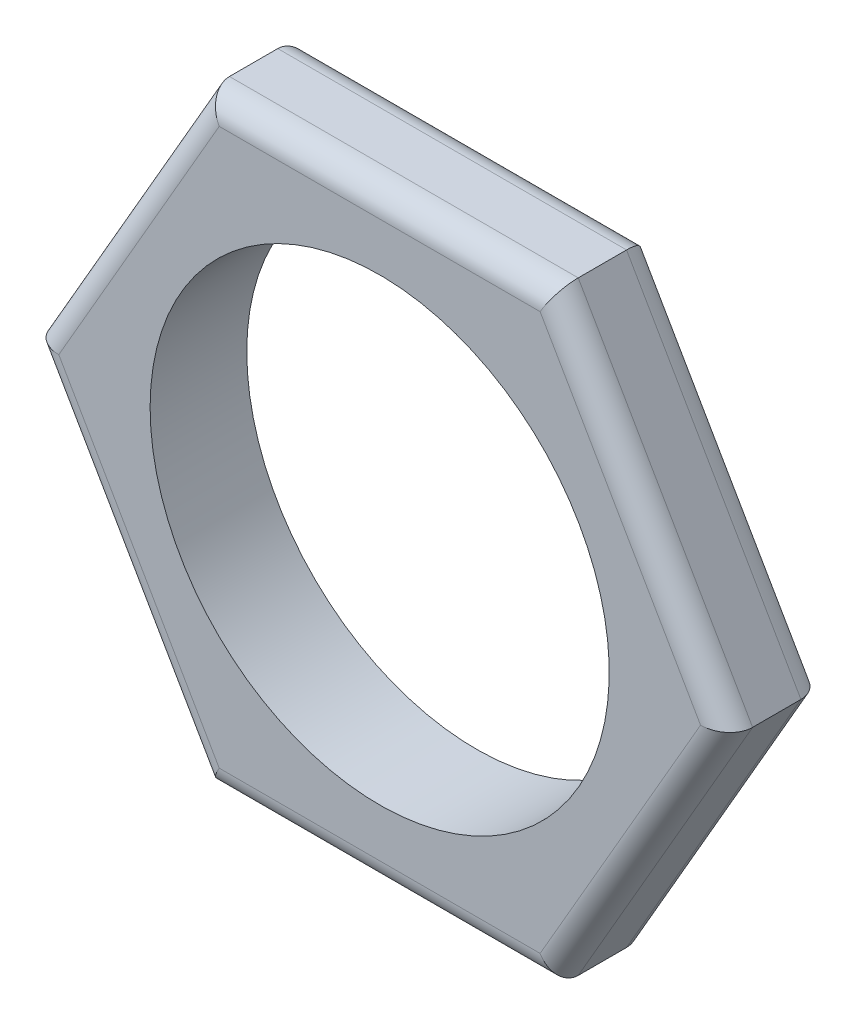
ISO-10303-21;
HEADER;
FILE_DESCRIPTION(('STEP AP214'),'2;1');
FILE_NAME('part.step','',(''),(''),'','','');
FILE_SCHEMA(('AUTOMOTIVE_DESIGN { 1 0 10303 214 1 1 1 1 }'));
ENDSEC;
DATA;
#1=APPLICATION_CONTEXT('core data for automotive mechanical design processes');
#2=APPLICATION_PROTOCOL_DEFINITION('international standard','automotive_design',2000,#1);
#3=PRODUCT_CONTEXT('',#1,'mechanical');
#4=PRODUCT('Part','Part','',(#3));
#5=PRODUCT_RELATED_PRODUCT_CATEGORY('part','',(#4));
#6=PRODUCT_DEFINITION_FORMATION('','',#4);
#7=PRODUCT_DEFINITION_CONTEXT('part definition',#1,'design');
#8=PRODUCT_DEFINITION('design','',#6,#7);
#9=PRODUCT_DEFINITION_SHAPE('','',#8);
#10=(LENGTH_UNIT() NAMED_UNIT(*) SI_UNIT(.MILLI.,.METRE.));
#11=(NAMED_UNIT(*) PLANE_ANGLE_UNIT() SI_UNIT($,.RADIAN.));
#12=(NAMED_UNIT(*) SI_UNIT($,.STERADIAN.) SOLID_ANGLE_UNIT());
#13=UNCERTAINTY_MEASURE_WITH_UNIT(LENGTH_MEASURE(1.E-05),#10,'distance_accuracy_value','');
#14=(GEOMETRIC_REPRESENTATION_CONTEXT(3) GLOBAL_UNCERTAINTY_ASSIGNED_CONTEXT((#13)) GLOBAL_UNIT_ASSIGNED_CONTEXT((#10,
#11,#12)) REPRESENTATION_CONTEXT('',''));
#15=CARTESIAN_POINT('',(0.,0.,0.));
#16=DIRECTION('',(0.,0.,1.));
#17=DIRECTION('',(1.,0.,0.));
#18=AXIS2_PLACEMENT_3D('',#15,#16,#17);
#19=CARTESIAN_POINT('',(-8.61550939198223,0.317499999999979,-0.635));
#20=DIRECTION('',(0.500000000000001,-0.866025403784438,0.));
#21=DIRECTION('',(0.866025403784438,0.500000000000001,0.));
#22=AXIS2_PLACEMENT_3D('',#19,#20,#21);
#23=CYLINDRICAL_SURFACE('',#22,0.635);
#24=CARTESIAN_POINT('',(-8.43220068151452,0.,-0.635));
#25=DIRECTION('',(0.,-1.,0.));
#26=DIRECTION('',(-1.,0.,0.));
#27=AXIS2_PLACEMENT_3D('',#24,#25,#26);
#28=ELLIPSE('',#27,0.733234841870825,0.635);
#29=CARTESIAN_POINT('',(-8.43220068151453,0.,-1.27));
#30=VERTEX_POINT('',#29);
#31=CARTESIAN_POINT('',(-9.16543552338535,0.,-0.635));
#32=VERTEX_POINT('',#31);
#33=EDGE_CURVE('E180',#30,#32,#28,.F.);
#34=ORIENTED_EDGE('',*,*,#33,.F.);
#35=DIRECTION('',(0.500000000000001,-0.866025403784438,0.));
#36=VECTOR('',#35,1.);
#37=CARTESIAN_POINT('',(-8.43220068151452,0.,-1.27));
#38=LINE('',#37,#36);
#39=CARTESIAN_POINT('',(-4.21610034075726,-7.30250000000004,-1.27));
#40=VERTEX_POINT('',#39);
#41=EDGE_CURVE('E108',#30,#40,#38,.T.);
#42=ORIENTED_EDGE('',*,*,#41,.T.);
#43=CARTESIAN_POINT('',(-4.21610034075726,-7.30250000000004,-0.635));
#44=DIRECTION('',(0.866025403784439,-0.499999999999999,0.));
#45=DIRECTION('',(0.499999999999999,0.866025403784439,0.));
#46=AXIS2_PLACEMENT_3D('',#43,#44,#45);
#47=ELLIPSE('',#46,0.733234841870825,0.635);
#48=CARTESIAN_POINT('',(-4.58271776169267,-7.93750000000004,-0.635));
#49=VERTEX_POINT('',#48);
#50=EDGE_CURVE('E20',#49,#40,#47,.T.);
#51=ORIENTED_EDGE('',*,*,#50,.F.);
#52=DIRECTION('',(-0.500000000000001,0.866025403784438,0.));
#53=VECTOR('',#52,1.);
#54=CARTESIAN_POINT('',(-9.16543552338535,0.,-0.635));
#55=LINE('',#54,#53);
#56=EDGE_CURVE('E105',#49,#32,#55,.T.);
#57=ORIENTED_EDGE('',*,*,#56,.T.);
#58=EDGE_LOOP('',(#34,#42,#51,#57));
#59=FACE_BOUND('',#58,.T.);
#60=ADVANCED_FACE('F17',(#59),#23,.T.);
#61=CARTESIAN_POINT('',(-4.58271776169267,-7.30250000000004,-0.635));
#62=DIRECTION('',(1.,0.,0.));
#63=DIRECTION('',(0.,0.,-1.));
#64=AXIS2_PLACEMENT_3D('',#61,#62,#63);
#65=CYLINDRICAL_SURFACE('',#64,0.635);
#66=CARTESIAN_POINT('',(4.21610034075723,-7.30250000000004,-0.635));
#67=DIRECTION('',(0.866025403784438,0.5,0.));
#68=DIRECTION('',(-0.5,0.866025403784438,0.));
#69=AXIS2_PLACEMENT_3D('',#66,#67,#68);
#70=ELLIPSE('',#69,0.733234841870825,0.635);
#71=CARTESIAN_POINT('',(4.58271776169264,-7.93750000000004,-0.635));
#72=VERTEX_POINT('',#71);
#73=CARTESIAN_POINT('',(4.21610034075723,-7.30250000000004,-1.27));
#74=VERTEX_POINT('',#73);
#75=EDGE_CURVE('E111',#72,#74,#70,.T.);
#76=ORIENTED_EDGE('',*,*,#75,.F.);
#77=DIRECTION('',(1.,0.,0.));
#78=VECTOR('',#77,1.);
#79=CARTESIAN_POINT('',(-4.58271776169267,-7.93750000000004,-0.635));
#80=LINE('',#79,#78);
#81=EDGE_CURVE('E113',#72,#49,#80,.F.);
#82=ORIENTED_EDGE('',*,*,#81,.T.);
#83=ORIENTED_EDGE('',*,*,#50,.T.);
#84=DIRECTION('',(1.,0.,0.));
#85=VECTOR('',#84,1.);
#86=CARTESIAN_POINT('',(0.,-7.30250000000004,-1.27));
#87=LINE('',#86,#85);
#88=EDGE_CURVE('E196',#40,#74,#87,.T.);
#89=ORIENTED_EDGE('',*,*,#88,.T.);
#90=EDGE_LOOP('',(#76,#82,#83,#89));
#91=FACE_BOUND('',#90,.T.);
#92=ADVANCED_FACE('F115',(#91),#65,.T.);
#93=CARTESIAN_POINT('',(4.03279163028952,-7.62000000000004,-0.635));
#94=DIRECTION('',(0.499999999999999,0.866025403784439,0.));
#95=DIRECTION('',(-0.866025403784439,0.499999999999999,0.));
#96=AXIS2_PLACEMENT_3D('',#93,#94,#95);
#97=CYLINDRICAL_SURFACE('',#96,0.635);
#98=CARTESIAN_POINT('',(8.43220068151448,0.,-0.635));
#99=DIRECTION('',(0.,1.,0.));
#100=DIRECTION('',(-1.,0.,0.));
#101=AXIS2_PLACEMENT_3D('',#98,#99,#100);
#102=ELLIPSE('',#101,0.733234841870824,0.635);
#103=CARTESIAN_POINT('',(9.16543552338531,0.,-0.635));
#104=VERTEX_POINT('',#103);
#105=CARTESIAN_POINT('',(8.43220068151448,0.,-1.27));
#106=VERTEX_POINT('',#105);
#107=EDGE_CURVE('E185',#104,#106,#102,.T.);
#108=ORIENTED_EDGE('',*,*,#107,.F.);
#109=DIRECTION('',(-0.499999999999999,-0.866025403784439,0.));
#110=VECTOR('',#109,1.);
#111=CARTESIAN_POINT('',(4.58271776169264,-7.93750000000004,-0.635));
#112=LINE('',#111,#110);
#113=EDGE_CURVE('E120',#104,#72,#112,.T.);
#114=ORIENTED_EDGE('',*,*,#113,.T.);
#115=ORIENTED_EDGE('',*,*,#75,.T.);
#116=DIRECTION('',(0.499999999999999,0.866025403784439,0.));
#117=VECTOR('',#116,1.);
#118=CARTESIAN_POINT('',(4.21610034075723,-7.30250000000004,-1.27));
#119=LINE('',#118,#117);
#120=EDGE_CURVE('E190',#74,#106,#119,.T.);
#121=ORIENTED_EDGE('',*,*,#120,.T.);
#122=EDGE_LOOP('',(#108,#114,#115,#121));
#123=FACE_BOUND('',#122,.T.);
#124=ADVANCED_FACE('F189',(#123),#97,.T.);
#125=CARTESIAN_POINT('',(8.61550939198219,-0.3175,-0.635));
#126=DIRECTION('',(-0.499999999999999,0.866025403784439,0.));
#127=DIRECTION('',(-0.866025403784439,-0.499999999999999,0.));
#128=AXIS2_PLACEMENT_3D('',#125,#126,#127);
#129=CYLINDRICAL_SURFACE('',#128,0.635);
#130=CARTESIAN_POINT('',(4.21610034075723,7.30250000000003,-0.635));
#131=DIRECTION('',(-0.866025403784438,0.5,0.));
#132=DIRECTION('',(-0.5,-0.866025403784438,0.));
#133=AXIS2_PLACEMENT_3D('',#130,#131,#132);
#134=ELLIPSE('',#133,0.733234841870825,0.635);
#135=CARTESIAN_POINT('',(4.58271776169264,7.93750000000003,-0.635));
#136=VERTEX_POINT('',#135);
#137=CARTESIAN_POINT('',(4.21610034075723,7.30250000000003,-1.27));
#138=VERTEX_POINT('',#137);
#139=EDGE_CURVE('E182',#136,#138,#134,.T.);
#140=ORIENTED_EDGE('',*,*,#139,.F.);
#141=DIRECTION('',(0.499999999999999,-0.866025403784439,0.));
#142=VECTOR('',#141,1.);
#143=CARTESIAN_POINT('',(9.16543552338531,0.,-0.635));
#144=LINE('',#143,#142);
#145=EDGE_CURVE('E148',#136,#104,#144,.T.);
#146=ORIENTED_EDGE('',*,*,#145,.T.);
#147=ORIENTED_EDGE('',*,*,#107,.T.);
#148=DIRECTION('',(-0.5,0.866025403784439,0.));
#149=VECTOR('',#148,1.);
#150=CARTESIAN_POINT('',(8.43220068151448,0.,-1.27));
#151=LINE('',#150,#149);
#152=EDGE_CURVE('E197',#106,#138,#151,.T.);
#153=ORIENTED_EDGE('',*,*,#152,.T.);
#154=EDGE_LOOP('',(#140,#146,#147,#153));
#155=FACE_BOUND('',#154,.T.);
#156=ADVANCED_FACE('F269',(#155),#129,.T.);
#157=CARTESIAN_POINT('',(4.58271776169264,7.30250000000003,-0.635));
#158=DIRECTION('',(-1.,0.,0.));
#159=DIRECTION('',(0.,0.,1.));
#160=AXIS2_PLACEMENT_3D('',#157,#158,#159);
#161=CYLINDRICAL_SURFACE('',#160,0.635);
#162=CARTESIAN_POINT('',(-4.21610034075725,7.30250000000003,-0.635));
#163=DIRECTION('',(-0.866025403784439,-0.5,0.));
#164=DIRECTION('',(0.5,-0.866025403784439,0.));
#165=AXIS2_PLACEMENT_3D('',#162,#163,#164);
#166=ELLIPSE('',#165,0.733234841870825,0.635);
#167=CARTESIAN_POINT('',(-4.58271776169266,7.93750000000003,-0.635));
#168=VERTEX_POINT('',#167);
#169=CARTESIAN_POINT('',(-4.21610034075725,7.30250000000003,-1.27));
#170=VERTEX_POINT('',#169);
#171=EDGE_CURVE('E121',#168,#170,#166,.T.);
#172=ORIENTED_EDGE('',*,*,#171,.F.);
#173=DIRECTION('',(1.,0.,0.));
#174=VECTOR('',#173,1.);
#175=CARTESIAN_POINT('',(4.58271776169264,7.93750000000003,-0.635));
#176=LINE('',#175,#174);
#177=EDGE_CURVE('E143',#168,#136,#176,.T.);
#178=ORIENTED_EDGE('',*,*,#177,.T.);
#179=ORIENTED_EDGE('',*,*,#139,.T.);
#180=DIRECTION('',(1.,0.,0.));
#181=VECTOR('',#180,1.);
#182=CARTESIAN_POINT('',(0.,7.30250000000003,-1.27));
#183=LINE('',#182,#181);
#184=EDGE_CURVE('E199',#138,#170,#183,.F.);
#185=ORIENTED_EDGE('',*,*,#184,.T.);
#186=EDGE_LOOP('',(#172,#178,#179,#185));
#187=FACE_BOUND('',#186,.T.);
#188=ADVANCED_FACE('F263',(#187),#161,.T.);
#189=CARTESIAN_POINT('',(-4.03279163028954,7.62000000000003,-0.635));
#190=DIRECTION('',(-0.5,-0.866025403784439,0.));
#191=DIRECTION('',(0.866025403784439,-0.5,0.));
#192=AXIS2_PLACEMENT_3D('',#189,#190,#191);
#193=CYLINDRICAL_SURFACE('',#192,0.635);
#194=ORIENTED_EDGE('',*,*,#171,.T.);
#195=DIRECTION('',(-0.5,-0.866025403784439,0.));
#196=VECTOR('',#195,1.);
#197=CARTESIAN_POINT('',(-4.21610034075725,7.30250000000003,-1.27));
#198=LINE('',#197,#196);
#199=EDGE_CURVE('E203',#170,#30,#198,.T.);
#200=ORIENTED_EDGE('',*,*,#199,.T.);
#201=ORIENTED_EDGE('',*,*,#33,.T.);
#202=DIRECTION('',(0.5,0.866025403784439,0.));
#203=VECTOR('',#202,1.);
#204=CARTESIAN_POINT('',(-4.58271776169266,7.93750000000003,-0.635));
#205=LINE('',#204,#203);
#206=EDGE_CURVE('E140',#32,#168,#205,.T.);
#207=ORIENTED_EDGE('',*,*,#206,.T.);
#208=EDGE_LOOP('',(#194,#200,#201,#207));
#209=FACE_BOUND('',#208,.T.);
#210=ADVANCED_FACE('F258',(#209),#193,.T.);
#211=CARTESIAN_POINT('',(-4.58271776169267,-7.93750000000004,1.27));
#212=DIRECTION('',(0.,1.,0.));
#213=DIRECTION('',(0.,0.,1.));
#214=AXIS2_PLACEMENT_3D('',#211,#212,#213);
#215=PLANE('',#214);
#216=ORIENTED_EDGE('',*,*,#81,.F.);
#217=DIRECTION('',(0.,0.,1.));
#218=VECTOR('',#217,1.);
#219=CARTESIAN_POINT('',(4.58271776169264,-7.93750000000004,1.27));
#220=LINE('',#219,#218);
#221=CARTESIAN_POINT('',(4.58271776169264,-7.93750000000004,0.635));
#222=VERTEX_POINT('',#221);
#223=EDGE_CURVE('E151',#72,#222,#220,.T.);
#224=ORIENTED_EDGE('',*,*,#223,.T.);
#225=DIRECTION('',(-1.,0.,0.));
#226=VECTOR('',#225,1.);
#227=CARTESIAN_POINT('',(0.,-7.93750000000004,0.635));
#228=LINE('',#227,#226);
#229=CARTESIAN_POINT('',(-4.58271776169267,-7.93750000000004,0.635));
#230=VERTEX_POINT('',#229);
#231=EDGE_CURVE('E128',#230,#222,#228,.F.);
#232=ORIENTED_EDGE('',*,*,#231,.F.);
#233=DIRECTION('',(0.,0.,1.));
#234=VECTOR('',#233,1.);
#235=CARTESIAN_POINT('',(-4.58271776169267,-7.93750000000004,1.27));
#236=LINE('',#235,#234);
#237=EDGE_CURVE('E125',#230,#49,#236,.F.);
#238=ORIENTED_EDGE('',*,*,#237,.T.);
#239=EDGE_LOOP('',(#216,#224,#232,#238));
#240=FACE_BOUND('',#239,.T.);
#241=ADVANCED_FACE('F126',(#240),#215,.F.);
#242=CARTESIAN_POINT('',(4.58271776169264,-7.93750000000004,1.27));
#243=DIRECTION('',(-0.866025403784439,0.499999999999999,0.));
#244=DIRECTION('',(-0.499999999999999,-0.866025403784439,0.));
#245=AXIS2_PLACEMENT_3D('',#242,#243,#244);
#246=PLANE('',#245);
#247=ORIENTED_EDGE('',*,*,#113,.F.);
#248=DIRECTION('',(0.,0.,1.));
#249=VECTOR('',#248,1.);
#250=CARTESIAN_POINT('',(9.16543552338531,0.,1.27));
#251=LINE('',#250,#249);
#252=CARTESIAN_POINT('',(9.16543552338531,0.,0.635));
#253=VERTEX_POINT('',#252);
#254=EDGE_CURVE('E147',#104,#253,#251,.T.);
#255=ORIENTED_EDGE('',*,*,#254,.T.);
#256=DIRECTION('',(-0.499999999999999,-0.866025403784439,0.));
#257=VECTOR('',#256,1.);
#258=CARTESIAN_POINT('',(6.87407664253899,-3.96874999999999,0.635));
#259=LINE('',#258,#257);
#260=EDGE_CURVE('E174',#222,#253,#259,.F.);
#261=ORIENTED_EDGE('',*,*,#260,.F.);
#262=ORIENTED_EDGE('',*,*,#223,.F.);
#263=EDGE_LOOP('',(#247,#255,#261,#262));
#264=FACE_BOUND('',#263,.T.);
#265=ADVANCED_FACE('F271',(#264),#246,.F.);
#266=CARTESIAN_POINT('',(9.16543552338531,0.,1.27));
#267=DIRECTION('',(-0.866025403784439,-0.499999999999999,0.));
#268=DIRECTION('',(0.499999999999999,-0.866025403784439,0.));
#269=AXIS2_PLACEMENT_3D('',#266,#267,#268);
#270=PLANE('',#269);
#271=ORIENTED_EDGE('',*,*,#145,.F.);
#272=DIRECTION('',(0.,0.,-1.));
#273=VECTOR('',#272,1.);
#274=CARTESIAN_POINT('',(4.58271776169264,7.93750000000003,1.27));
#275=LINE('',#274,#273);
#276=CARTESIAN_POINT('',(4.58271776169264,7.93750000000003,0.635));
#277=VERTEX_POINT('',#276);
#278=EDGE_CURVE('E146',#136,#277,#275,.F.);
#279=ORIENTED_EDGE('',*,*,#278,.T.);
#280=DIRECTION('',(0.499999999999999,-0.866025403784439,0.));
#281=VECTOR('',#280,1.);
#282=CARTESIAN_POINT('',(6.87407664253899,3.96875,0.635));
#283=LINE('',#282,#281);
#284=EDGE_CURVE('E170',#253,#277,#283,.F.);
#285=ORIENTED_EDGE('',*,*,#284,.F.);
#286=ORIENTED_EDGE('',*,*,#254,.F.);
#287=EDGE_LOOP('',(#271,#279,#285,#286));
#288=FACE_BOUND('',#287,.T.);
#289=ADVANCED_FACE('F266',(#288),#270,.F.);
#290=CARTESIAN_POINT('',(4.58271776169264,7.93750000000003,1.27));
#291=DIRECTION('',(0.,-1.,0.));
#292=DIRECTION('',(0.,0.,-1.));
#293=AXIS2_PLACEMENT_3D('',#290,#291,#292);
#294=PLANE('',#293);
#295=ORIENTED_EDGE('',*,*,#177,.F.);
#296=DIRECTION('',(0.,0.,1.));
#297=VECTOR('',#296,1.);
#298=CARTESIAN_POINT('',(-4.58271776169266,7.93750000000003,1.27));
#299=LINE('',#298,#297);
#300=CARTESIAN_POINT('',(-4.58271776169266,7.93750000000003,0.635));
#301=VERTEX_POINT('',#300);
#302=EDGE_CURVE('E132',#168,#301,#299,.T.);
#303=ORIENTED_EDGE('',*,*,#302,.T.);
#304=DIRECTION('',(1.,0.,0.));
#305=VECTOR('',#304,1.);
#306=CARTESIAN_POINT('',(0.,7.93750000000003,0.635));
#307=LINE('',#306,#305);
#308=EDGE_CURVE('E166',#277,#301,#307,.F.);
#309=ORIENTED_EDGE('',*,*,#308,.F.);
#310=ORIENTED_EDGE('',*,*,#278,.F.);
#311=EDGE_LOOP('',(#295,#303,#309,#310));
#312=FACE_BOUND('',#311,.T.);
#313=ADVANCED_FACE('F260',(#312),#294,.F.);
#314=CARTESIAN_POINT('',(-4.58271776169266,7.93750000000003,1.27));
#315=DIRECTION('',(0.866025403784439,-0.5,0.));
#316=DIRECTION('',(0.5,0.866025403784439,0.));
#317=AXIS2_PLACEMENT_3D('',#314,#315,#316);
#318=PLANE('',#317);
#319=ORIENTED_EDGE('',*,*,#206,.F.);
#320=DIRECTION('',(0.,0.,1.));
#321=VECTOR('',#320,1.);
#322=CARTESIAN_POINT('',(-9.16543552338535,0.,1.27));
#323=LINE('',#322,#321);
#324=CARTESIAN_POINT('',(-9.16543552338535,0.,0.635));
#325=VERTEX_POINT('',#324);
#326=EDGE_CURVE('E136',#32,#325,#323,.T.);
#327=ORIENTED_EDGE('',*,*,#326,.T.);
#328=DIRECTION('',(0.5,0.866025403784439,0.));
#329=VECTOR('',#328,1.);
#330=CARTESIAN_POINT('',(-6.874076642539,3.96875000000001,0.635));
#331=LINE('',#330,#329);
#332=EDGE_CURVE('E162',#301,#325,#331,.F.);
#333=ORIENTED_EDGE('',*,*,#332,.F.);
#334=ORIENTED_EDGE('',*,*,#302,.F.);
#335=EDGE_LOOP('',(#319,#327,#333,#334));
#336=FACE_BOUND('',#335,.T.);
#337=ADVANCED_FACE('F254',(#336),#318,.F.);
#338=CARTESIAN_POINT('',(-9.16543552338535,0.,1.27));
#339=DIRECTION('',(0.866025403784438,0.500000000000001,0.));
#340=DIRECTION('',(-0.500000000000001,0.866025403784438,0.));
#341=AXIS2_PLACEMENT_3D('',#338,#339,#340);
#342=PLANE('',#341);
#343=ORIENTED_EDGE('',*,*,#56,.F.);
#344=ORIENTED_EDGE('',*,*,#237,.F.);
#345=DIRECTION('',(-0.500000000000001,0.866025403784438,0.));
#346=VECTOR('',#345,1.);
#347=CARTESIAN_POINT('',(-6.87407664253901,-3.96875000000003,0.635));
#348=LINE('',#347,#346);
#349=EDGE_CURVE('E160',#325,#230,#348,.F.);
#350=ORIENTED_EDGE('',*,*,#349,.F.);
#351=ORIENTED_EDGE('',*,*,#326,.F.);
#352=EDGE_LOOP('',(#343,#344,#350,#351));
#353=FACE_BOUND('',#352,.T.);
#354=ADVANCED_FACE('F135',(#353),#342,.F.);
#355=CARTESIAN_POINT('',(0.,0.,-1.27));
#356=DIRECTION('',(0.,0.,1.));
#357=DIRECTION('',(1.,0.,0.));
#358=AXIS2_PLACEMENT_3D('',#355,#356,#357);
#359=PLANE('',#358);
#360=CARTESIAN_POINT('',(0.,0.,-1.27));
#361=DIRECTION('',(0.,0.,-1.));
#362=DIRECTION('',(-1.,0.,0.));
#363=AXIS2_PLACEMENT_3D('',#360,#361,#362);
#364=CIRCLE('',#363,6.0325);
#365=CARTESIAN_POINT('',(-6.0325,0.,-1.27));
#366=VERTEX_POINT('',#365);
#367=EDGE_CURVE('E153',#366,#366,#364,.F.);
#368=ORIENTED_EDGE('',*,*,#367,.T.);
#369=EDGE_LOOP('',(#368));
#370=FACE_BOUND('',#369,.T.);
#371=ORIENTED_EDGE('',*,*,#184,.F.);
#372=ORIENTED_EDGE('',*,*,#152,.F.);
#373=ORIENTED_EDGE('',*,*,#120,.F.);
#374=ORIENTED_EDGE('',*,*,#88,.F.);
#375=ORIENTED_EDGE('',*,*,#41,.F.);
#376=ORIENTED_EDGE('',*,*,#199,.F.);
#377=EDGE_LOOP('',(#371,#372,#373,#374,#375,#376));
#378=FACE_BOUND('',#377,.T.);
#379=ADVANCED_FACE('F195',(#370,#378),#359,.F.);
#380=CARTESIAN_POINT('',(0.,-7.30250000000004,0.635));
#381=DIRECTION('',(-1.,0.,0.));
#382=DIRECTION('',(0.,0.,1.));
#383=AXIS2_PLACEMENT_3D('',#380,#381,#382);
#384=CYLINDRICAL_SURFACE('',#383,0.635);
#385=CARTESIAN_POINT('',(4.21610034075723,-7.30250000000004,0.635));
#386=DIRECTION('',(-0.866025403784438,-0.5,0.));
#387=DIRECTION('',(0.5,-0.866025403784438,0.));
#388=AXIS2_PLACEMENT_3D('',#385,#386,#387);
#389=ELLIPSE('',#388,0.733234841870825,0.635);
#390=CARTESIAN_POINT('',(4.21610034075723,-7.30250000000004,1.27));
#391=VERTEX_POINT('',#390);
#392=EDGE_CURVE('E175',#391,#222,#389,.F.);
#393=ORIENTED_EDGE('',*,*,#392,.F.);
#394=DIRECTION('',(1.,0.,0.));
#395=VECTOR('',#394,1.);
#396=CARTESIAN_POINT('',(0.,-7.30250000000004,1.27));
#397=LINE('',#396,#395);
#398=CARTESIAN_POINT('',(-4.21610034075726,-7.30250000000004,1.27));
#399=VERTEX_POINT('',#398);
#400=EDGE_CURVE('E156',#399,#391,#397,.T.);
#401=ORIENTED_EDGE('',*,*,#400,.F.);
#402=CARTESIAN_POINT('',(-4.21610034075726,-7.30250000000004,0.635));
#403=DIRECTION('',(-0.866025403784439,0.499999999999999,0.));
#404=DIRECTION('',(0.499999999999999,0.866025403784439,0.));
#405=AXIS2_PLACEMENT_3D('',#402,#403,#404);
#406=ELLIPSE('',#405,0.733234841870825,0.635);
#407=EDGE_CURVE('E157',#230,#399,#406,.T.);
#408=ORIENTED_EDGE('',*,*,#407,.F.);
#409=ORIENTED_EDGE('',*,*,#231,.T.);
#410=EDGE_LOOP('',(#393,#401,#408,#409));
#411=FACE_BOUND('',#410,.T.);
#412=ADVANCED_FACE('F240',(#411),#384,.T.);
#413=CARTESIAN_POINT('',(6.32415051113587,-3.65124999999999,0.635));
#414=DIRECTION('',(-0.499999999999999,-0.866025403784439,0.));
#415=DIRECTION('',(0.866025403784439,-0.499999999999999,0.));
#416=AXIS2_PLACEMENT_3D('',#413,#414,#415);
#417=CYLINDRICAL_SURFACE('',#416,0.635);
#418=CARTESIAN_POINT('',(8.43220068151448,0.,0.635));
#419=DIRECTION('',(0.,-1.,0.));
#420=DIRECTION('',(1.,0.,0.));
#421=AXIS2_PLACEMENT_3D('',#418,#419,#420);
#422=ELLIPSE('',#421,0.733234841870824,0.635);
#423=CARTESIAN_POINT('',(8.43220068151448,0.,1.27));
#424=VERTEX_POINT('',#423);
#425=EDGE_CURVE('E171',#424,#253,#422,.F.);
#426=ORIENTED_EDGE('',*,*,#425,.F.);
#427=DIRECTION('',(0.499999999999999,0.866025403784439,0.));
#428=VECTOR('',#427,1.);
#429=CARTESIAN_POINT('',(4.21610034075723,-7.30250000000004,1.27));
#430=LINE('',#429,#428);
#431=EDGE_CURVE('E214',#391,#424,#430,.T.);
#432=ORIENTED_EDGE('',*,*,#431,.F.);
#433=ORIENTED_EDGE('',*,*,#392,.T.);
#434=ORIENTED_EDGE('',*,*,#260,.T.);
#435=EDGE_LOOP('',(#426,#432,#433,#434));
#436=FACE_BOUND('',#435,.T.);
#437=ADVANCED_FACE('F274',(#436),#417,.T.);
#438=CARTESIAN_POINT('',(6.32415051113587,3.65125,0.635));
#439=DIRECTION('',(0.499999999999999,-0.866025403784439,0.));
#440=DIRECTION('',(0.866025403784439,0.499999999999999,0.));
#441=AXIS2_PLACEMENT_3D('',#438,#439,#440);
#442=CYLINDRICAL_SURFACE('',#441,0.635);
#443=ORIENTED_EDGE('',*,*,#425,.T.);
#444=ORIENTED_EDGE('',*,*,#284,.T.);
#445=CARTESIAN_POINT('',(4.21610034075723,7.30250000000003,0.635));
#446=DIRECTION('',(0.866025403784438,-0.5,0.));
#447=DIRECTION('',(0.5,0.866025403784438,0.));
#448=AXIS2_PLACEMENT_3D('',#445,#446,#447);
#449=ELLIPSE('',#448,0.733234841870825,0.635);
#450=CARTESIAN_POINT('',(4.21610034075723,7.30250000000004,1.27));
#451=VERTEX_POINT('',#450);
#452=EDGE_CURVE('E167',#451,#277,#449,.F.);
#453=ORIENTED_EDGE('',*,*,#452,.F.);
#454=DIRECTION('',(-0.499999999999999,0.866025403784439,0.));
#455=VECTOR('',#454,1.);
#456=CARTESIAN_POINT('',(8.43220068151448,0.,1.27));
#457=LINE('',#456,#455);
#458=EDGE_CURVE('E217',#424,#451,#457,.T.);
#459=ORIENTED_EDGE('',*,*,#458,.F.);
#460=EDGE_LOOP('',(#443,#444,#453,#459));
#461=FACE_BOUND('',#460,.T.);
#462=ADVANCED_FACE('F277',(#461),#442,.T.);
#463=CARTESIAN_POINT('',(0.,7.30250000000003,0.635));
#464=DIRECTION('',(1.,0.,0.));
#465=DIRECTION('',(0.,0.,-1.));
#466=AXIS2_PLACEMENT_3D('',#463,#464,#465);
#467=CYLINDRICAL_SURFACE('',#466,0.635);
#468=ORIENTED_EDGE('',*,*,#452,.T.);
#469=ORIENTED_EDGE('',*,*,#308,.T.);
#470=CARTESIAN_POINT('',(-4.21610034075725,7.30250000000003,0.635));
#471=DIRECTION('',(0.866025403784439,0.5,0.));
#472=DIRECTION('',(-0.5,0.866025403784439,0.));
#473=AXIS2_PLACEMENT_3D('',#470,#471,#472);
#474=ELLIPSE('',#473,0.733234841870825,0.635);
#475=CARTESIAN_POINT('',(-4.21610034075725,7.30250000000003,1.27));
#476=VERTEX_POINT('',#475);
#477=EDGE_CURVE('E163',#476,#301,#474,.F.);
#478=ORIENTED_EDGE('',*,*,#477,.F.);
#479=DIRECTION('',(1.,0.,0.));
#480=VECTOR('',#479,1.);
#481=CARTESIAN_POINT('',(0.,7.30250000000003,1.27));
#482=LINE('',#481,#480);
#483=EDGE_CURVE('E222',#451,#476,#482,.F.);
#484=ORIENTED_EDGE('',*,*,#483,.F.);
#485=EDGE_LOOP('',(#468,#469,#478,#484));
#486=FACE_BOUND('',#485,.T.);
#487=ADVANCED_FACE('F248',(#486),#467,.T.);
#488=CARTESIAN_POINT('',(-6.32415051113588,3.65125000000001,0.635));
#489=DIRECTION('',(0.5,0.866025403784439,0.));
#490=DIRECTION('',(-0.866025403784439,0.5,0.));
#491=AXIS2_PLACEMENT_3D('',#488,#489,#490);
#492=CYLINDRICAL_SURFACE('',#491,0.635);
#493=CARTESIAN_POINT('',(-8.43220068151452,0.,0.635));
#494=DIRECTION('',(0.,1.,0.));
#495=DIRECTION('',(-1.,0.,0.));
#496=AXIS2_PLACEMENT_3D('',#493,#494,#495);
#497=ELLIPSE('',#496,0.733234841870825,0.635);
#498=CARTESIAN_POINT('',(-8.43220068151452,0.,1.27));
#499=VERTEX_POINT('',#498);
#500=EDGE_CURVE('E35',#499,#325,#497,.F.);
#501=ORIENTED_EDGE('',*,*,#500,.F.);
#502=DIRECTION('',(-0.5,-0.866025403784438,0.));
#503=VECTOR('',#502,1.);
#504=CARTESIAN_POINT('',(-4.21610034075725,7.30250000000003,1.27));
#505=LINE('',#504,#503);
#506=EDGE_CURVE('E227',#476,#499,#505,.T.);
#507=ORIENTED_EDGE('',*,*,#506,.F.);
#508=ORIENTED_EDGE('',*,*,#477,.T.);
#509=ORIENTED_EDGE('',*,*,#332,.T.);
#510=EDGE_LOOP('',(#501,#507,#508,#509));
#511=FACE_BOUND('',#510,.T.);
#512=ADVANCED_FACE('F245',(#511),#492,.T.);
#513=CARTESIAN_POINT('',(-6.32415051113589,-3.65125000000003,0.635));
#514=DIRECTION('',(-0.500000000000001,0.866025403784438,0.));
#515=DIRECTION('',(-0.866025403784438,-0.500000000000001,0.));
#516=AXIS2_PLACEMENT_3D('',#513,#514,#515);
#517=CYLINDRICAL_SURFACE('',#516,0.635);
#518=ORIENTED_EDGE('',*,*,#407,.T.);
#519=DIRECTION('',(0.500000000000001,-0.866025403784438,0.));
#520=VECTOR('',#519,1.);
#521=CARTESIAN_POINT('',(-8.43220068151452,0.,1.27));
#522=LINE('',#521,#520);
#523=EDGE_CURVE('E26',#499,#399,#522,.T.);
#524=ORIENTED_EDGE('',*,*,#523,.F.);
#525=ORIENTED_EDGE('',*,*,#500,.T.);
#526=ORIENTED_EDGE('',*,*,#349,.T.);
#527=EDGE_LOOP('',(#518,#524,#525,#526));
#528=FACE_BOUND('',#527,.T.);
#529=ADVANCED_FACE('F237',(#528),#517,.T.);
#530=CARTESIAN_POINT('',(0.,0.,1.27));
#531=DIRECTION('',(0.,0.,-1.));
#532=DIRECTION('',(-1.,0.,0.));
#533=AXIS2_PLACEMENT_3D('',#530,#531,#532);
#534=CYLINDRICAL_SURFACE('',#533,6.0325);
#535=CARTESIAN_POINT('',(0.,0.,1.27));
#536=DIRECTION('',(0.,0.,-1.));
#537=DIRECTION('',(-1.,0.,0.));
#538=AXIS2_PLACEMENT_3D('',#535,#536,#537);
#539=CIRCLE('',#538,6.0325);
#540=CARTESIAN_POINT('',(-6.0325,0.,1.27));
#541=VERTEX_POINT('',#540);
#542=EDGE_CURVE('E11',#541,#541,#539,.T.);
#543=ORIENTED_EDGE('',*,*,#542,.F.);
#544=EDGE_LOOP('',(#543));
#545=FACE_BOUND('',#544,.T.);
#546=ORIENTED_EDGE('',*,*,#367,.F.);
#547=EDGE_LOOP('',(#546));
#548=FACE_BOUND('',#547,.T.);
#549=ADVANCED_FACE('F288',(#545,#548),#534,.F.);
#550=CARTESIAN_POINT('',(0.,0.,1.27));
#551=DIRECTION('',(0.,0.,1.));
#552=DIRECTION('',(1.,0.,0.));
#553=AXIS2_PLACEMENT_3D('',#550,#551,#552);
#554=PLANE('',#553);
#555=ORIENTED_EDGE('',*,*,#542,.T.);
#556=EDGE_LOOP('',(#555));
#557=FACE_BOUND('',#556,.T.);
#558=ORIENTED_EDGE('',*,*,#506,.T.);
#559=ORIENTED_EDGE('',*,*,#523,.T.);
#560=ORIENTED_EDGE('',*,*,#400,.T.);
#561=ORIENTED_EDGE('',*,*,#431,.T.);
#562=ORIENTED_EDGE('',*,*,#458,.T.);
#563=ORIENTED_EDGE('',*,*,#483,.T.);
#564=EDGE_LOOP('',(#558,#559,#560,#561,#562,#563));
#565=FACE_BOUND('',#564,.T.);
#566=ADVANCED_FACE('F243',(#557,#565),#554,.T.);
#567=CLOSED_SHELL('',(#60,#92,#124,#156,#188,#210,#241,#265,#289,#313,#337,#354,#379,#412,#437,
#462,#487,#512,#529,#549,#566));
#568=MANIFOLD_SOLID_BREP('B1',#567);
#569=ADVANCED_BREP_SHAPE_REPRESENTATION('',(#18,#568),#14);
#570=SHAPE_DEFINITION_REPRESENTATION(#9,#569);
ENDSEC;
END-ISO-10303-21;
